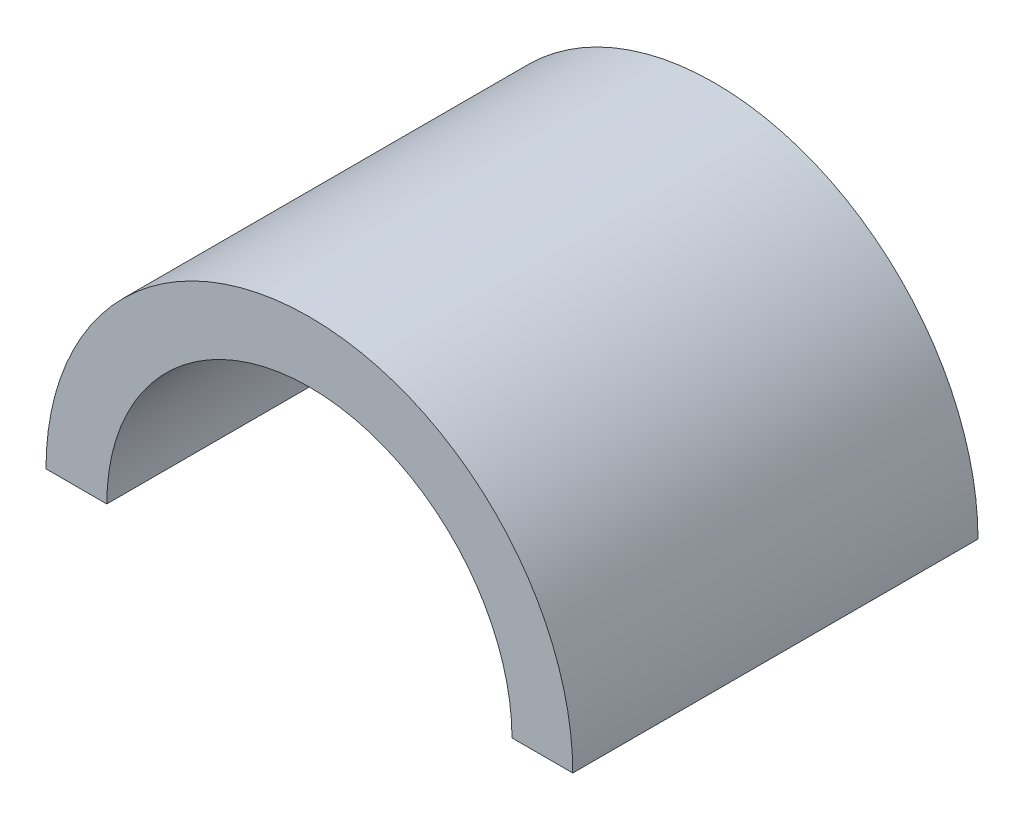
ISO-10303-21;
HEADER;
FILE_DESCRIPTION(('STEP AP214'),'2;1');
FILE_NAME('part.step','',(''),(''),'','','');
FILE_SCHEMA(('AUTOMOTIVE_DESIGN { 1 0 10303 214 1 1 1 1 }'));
ENDSEC;
DATA;
#1=APPLICATION_CONTEXT('core data for automotive mechanical design processes');
#2=APPLICATION_PROTOCOL_DEFINITION('international standard','automotive_design',2000,#1);
#3=PRODUCT_CONTEXT('',#1,'mechanical');
#4=PRODUCT('Part','Part','',(#3));
#5=PRODUCT_RELATED_PRODUCT_CATEGORY('part','',(#4));
#6=PRODUCT_DEFINITION_FORMATION('','',#4);
#7=PRODUCT_DEFINITION_CONTEXT('part definition',#1,'design');
#8=PRODUCT_DEFINITION('design','',#6,#7);
#9=PRODUCT_DEFINITION_SHAPE('','',#8);
#10=(LENGTH_UNIT() NAMED_UNIT(*) SI_UNIT(.MILLI.,.METRE.));
#11=(NAMED_UNIT(*) PLANE_ANGLE_UNIT() SI_UNIT($,.RADIAN.));
#12=(NAMED_UNIT(*) SI_UNIT($,.STERADIAN.) SOLID_ANGLE_UNIT());
#13=UNCERTAINTY_MEASURE_WITH_UNIT(LENGTH_MEASURE(1.E-05),#10,'distance_accuracy_value','');
#14=(GEOMETRIC_REPRESENTATION_CONTEXT(3) GLOBAL_UNCERTAINTY_ASSIGNED_CONTEXT((#13)) GLOBAL_UNIT_ASSIGNED_CONTEXT((#10,
#11,#12)) REPRESENTATION_CONTEXT('',''));
#15=CARTESIAN_POINT('',(0.,0.,0.));
#16=DIRECTION('',(0.,0.,1.));
#17=DIRECTION('',(1.,0.,0.));
#18=AXIS2_PLACEMENT_3D('',#15,#16,#17);
#19=CARTESIAN_POINT('',(0.,0.,31.75));
#20=DIRECTION('',(0.,1.,0.));
#21=DIRECTION('',(0.,0.,1.));
#22=AXIS2_PLACEMENT_3D('',#19,#20,#21);
#23=PLANE('',#22);
#24=DIRECTION('',(1.,0.,0.));
#25=VECTOR('',#24,1.);
#26=CARTESIAN_POINT('',(0.,0.,-31.75));
#27=LINE('',#26,#25);
#28=CARTESIAN_POINT('',(120.65,0.,-31.75));
#29=VERTEX_POINT('',#28);
#30=CARTESIAN_POINT('',(130.175,0.,-31.75));
#31=VERTEX_POINT('',#30);
#32=EDGE_CURVE('E98',#29,#31,#27,.T.);
#33=ORIENTED_EDGE('',*,*,#32,.T.);
#34=DIRECTION('',(0.,0.,-1.));
#35=VECTOR('',#34,1.);
#36=CARTESIAN_POINT('',(130.175,0.,31.75));
#37=LINE('',#36,#35);
#38=CARTESIAN_POINT('',(130.175,0.,31.75));
#39=VERTEX_POINT('',#38);
#40=EDGE_CURVE('E11',#39,#31,#37,.T.);
#41=ORIENTED_EDGE('',*,*,#40,.F.);
#42=DIRECTION('',(1.,0.,0.));
#43=VECTOR('',#42,1.);
#44=CARTESIAN_POINT('',(0.,0.,31.75));
#45=LINE('',#44,#43);
#46=CARTESIAN_POINT('',(120.65,0.,31.75));
#47=VERTEX_POINT('',#46);
#48=EDGE_CURVE('E84',#47,#39,#45,.T.);
#49=ORIENTED_EDGE('',*,*,#48,.F.);
#50=DIRECTION('',(0.,0.,-1.));
#51=VECTOR('',#50,1.);
#52=CARTESIAN_POINT('',(120.65,0.,31.75));
#53=LINE('',#52,#51);
#54=EDGE_CURVE('E51',#47,#29,#53,.T.);
#55=ORIENTED_EDGE('',*,*,#54,.T.);
#56=EDGE_LOOP('',(#33,#41,#49,#55));
#57=FACE_BOUND('',#56,.T.);
#58=ADVANCED_FACE('F35',(#57),#23,.F.);
#59=CARTESIAN_POINT('',(88.9,0.,31.75));
#60=DIRECTION('',(0.,0.,-1.));
#61=DIRECTION('',(-1.,0.,0.));
#62=AXIS2_PLACEMENT_3D('',#59,#60,#61);
#63=CYLINDRICAL_SURFACE('',#62,41.275);
#64=CARTESIAN_POINT('',(88.9,0.,-31.75));
#65=DIRECTION('',(0.,0.,1.));
#66=DIRECTION('',(1.,0.,0.));
#67=AXIS2_PLACEMENT_3D('',#64,#65,#66);
#68=CIRCLE('',#67,41.275);
#69=CARTESIAN_POINT('',(47.625,0.,-31.75));
#70=VERTEX_POINT('',#69);
#71=EDGE_CURVE('E89',#31,#70,#68,.T.);
#72=ORIENTED_EDGE('',*,*,#71,.T.);
#73=DIRECTION('',(0.,0.,-1.));
#74=VECTOR('',#73,1.);
#75=CARTESIAN_POINT('',(47.625,0.,31.75));
#76=LINE('',#75,#74);
#77=CARTESIAN_POINT('',(47.625,0.,31.75));
#78=VERTEX_POINT('',#77);
#79=EDGE_CURVE('E43',#78,#70,#76,.T.);
#80=ORIENTED_EDGE('',*,*,#79,.F.);
#81=CARTESIAN_POINT('',(88.9,0.,31.75));
#82=DIRECTION('',(0.,0.,1.));
#83=DIRECTION('',(1.,0.,0.));
#84=AXIS2_PLACEMENT_3D('',#81,#82,#83);
#85=CIRCLE('',#84,41.275);
#86=EDGE_CURVE('E77',#39,#78,#85,.T.);
#87=ORIENTED_EDGE('',*,*,#86,.F.);
#88=ORIENTED_EDGE('',*,*,#40,.T.);
#89=EDGE_LOOP('',(#72,#80,#87,#88));
#90=FACE_BOUND('',#89,.T.);
#91=ADVANCED_FACE('F88',(#90),#63,.T.);
#92=CARTESIAN_POINT('',(0.,0.,31.75));
#93=DIRECTION('',(0.,1.,0.));
#94=DIRECTION('',(0.,0.,1.));
#95=AXIS2_PLACEMENT_3D('',#92,#93,#94);
#96=PLANE('',#95);
#97=DIRECTION('',(1.,0.,0.));
#98=VECTOR('',#97,1.);
#99=CARTESIAN_POINT('',(0.,0.,-31.75));
#100=LINE('',#99,#98);
#101=CARTESIAN_POINT('',(57.15,0.,-31.75));
#102=VERTEX_POINT('',#101);
#103=EDGE_CURVE('E101',#70,#102,#100,.T.);
#104=ORIENTED_EDGE('',*,*,#103,.T.);
#105=DIRECTION('',(0.,0.,-1.));
#106=VECTOR('',#105,1.);
#107=CARTESIAN_POINT('',(57.15,0.,31.75));
#108=LINE('',#107,#106);
#109=CARTESIAN_POINT('',(57.15,0.,31.75));
#110=VERTEX_POINT('',#109);
#111=EDGE_CURVE('E66',#110,#102,#108,.T.);
#112=ORIENTED_EDGE('',*,*,#111,.F.);
#113=DIRECTION('',(1.,0.,0.));
#114=VECTOR('',#113,1.);
#115=CARTESIAN_POINT('',(0.,0.,31.75));
#116=LINE('',#115,#114);
#117=EDGE_CURVE('E83',#78,#110,#116,.T.);
#118=ORIENTED_EDGE('',*,*,#117,.F.);
#119=ORIENTED_EDGE('',*,*,#79,.T.);
#120=EDGE_LOOP('',(#104,#112,#118,#119));
#121=FACE_BOUND('',#120,.T.);
#122=ADVANCED_FACE('F92',(#121),#96,.F.);
#123=CARTESIAN_POINT('',(88.9,0.,31.75));
#124=DIRECTION('',(0.,0.,-1.));
#125=DIRECTION('',(-1.,0.,0.));
#126=AXIS2_PLACEMENT_3D('',#123,#124,#125);
#127=CYLINDRICAL_SURFACE('',#126,31.75);
#128=CARTESIAN_POINT('',(88.9,0.,-31.75));
#129=DIRECTION('',(0.,0.,1.));
#130=DIRECTION('',(1.,0.,0.));
#131=AXIS2_PLACEMENT_3D('',#128,#129,#130);
#132=CIRCLE('',#131,31.75);
#133=EDGE_CURVE('E103',#29,#102,#132,.T.);
#134=ORIENTED_EDGE('',*,*,#133,.F.);
#135=ORIENTED_EDGE('',*,*,#54,.F.);
#136=CARTESIAN_POINT('',(88.9,0.,31.75));
#137=DIRECTION('',(0.,0.,1.));
#138=DIRECTION('',(1.,0.,0.));
#139=AXIS2_PLACEMENT_3D('',#136,#137,#138);
#140=CIRCLE('',#139,31.75);
#141=EDGE_CURVE('E93',#47,#110,#140,.T.);
#142=ORIENTED_EDGE('',*,*,#141,.T.);
#143=ORIENTED_EDGE('',*,*,#111,.T.);
#144=EDGE_LOOP('',(#134,#135,#142,#143));
#145=FACE_BOUND('',#144,.T.);
#146=ADVANCED_FACE('F109',(#145),#127,.F.);
#147=CARTESIAN_POINT('',(0.,0.,31.75));
#148=DIRECTION('',(0.,0.,1.));
#149=DIRECTION('',(1.,0.,0.));
#150=AXIS2_PLACEMENT_3D('',#147,#148,#149);
#151=PLANE('',#150);
#152=ORIENTED_EDGE('',*,*,#48,.T.);
#153=ORIENTED_EDGE('',*,*,#86,.T.);
#154=ORIENTED_EDGE('',*,*,#117,.T.);
#155=ORIENTED_EDGE('',*,*,#141,.F.);
#156=EDGE_LOOP('',(#152,#153,#154,#155));
#157=FACE_BOUND('',#156,.T.);
#158=ADVANCED_FACE('F80',(#157),#151,.T.);
#159=CARTESIAN_POINT('',(0.,0.,-31.75));
#160=DIRECTION('',(0.,0.,1.));
#161=DIRECTION('',(1.,0.,0.));
#162=AXIS2_PLACEMENT_3D('',#159,#160,#161);
#163=PLANE('',#162);
#164=ORIENTED_EDGE('',*,*,#32,.F.);
#165=ORIENTED_EDGE('',*,*,#133,.T.);
#166=ORIENTED_EDGE('',*,*,#103,.F.);
#167=ORIENTED_EDGE('',*,*,#71,.F.);
#168=EDGE_LOOP('',(#164,#165,#166,#167));
#169=FACE_BOUND('',#168,.T.);
#170=ADVANCED_FACE('F108',(#169),#163,.F.);
#171=CLOSED_SHELL('',(#58,#91,#122,#146,#158,#170));
#172=MANIFOLD_SOLID_BREP('B2',#171);
#173=ADVANCED_BREP_SHAPE_REPRESENTATION('',(#18,#172),#14);
#174=SHAPE_DEFINITION_REPRESENTATION(#9,#173);
ENDSEC;
END-ISO-10303-21;
